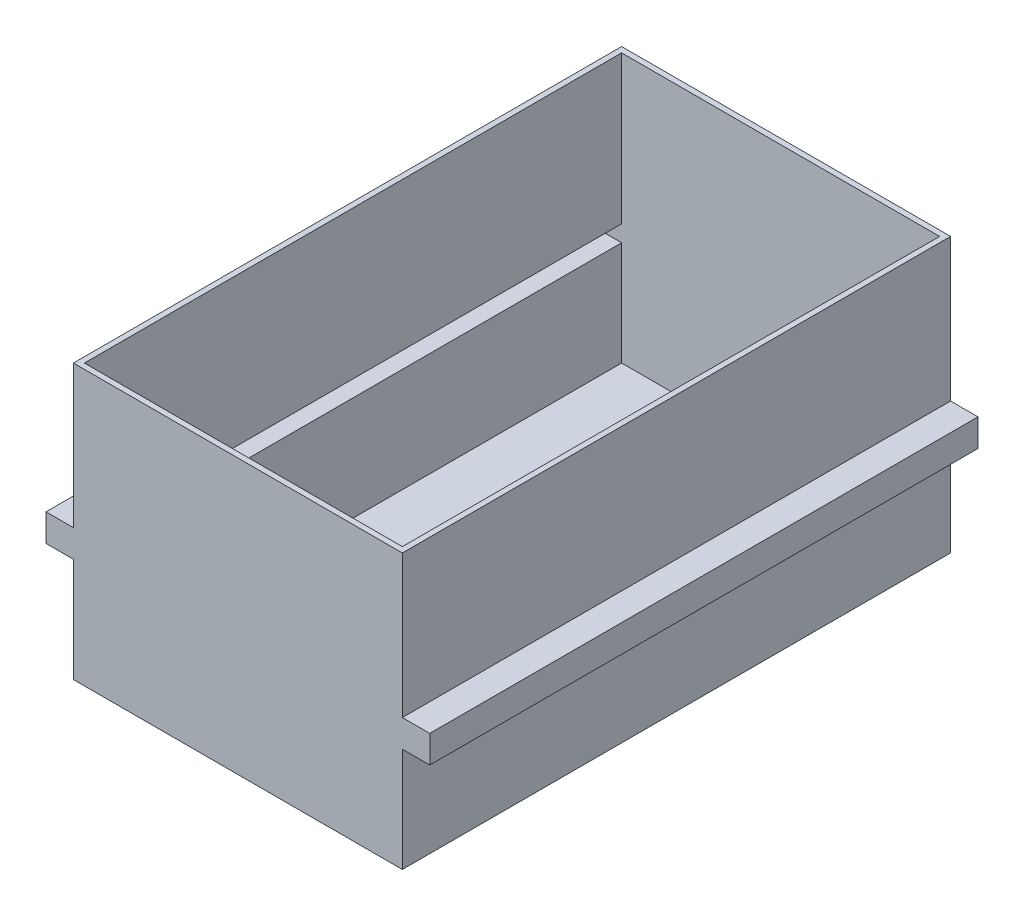
ISO-10303-21;
HEADER;
FILE_DESCRIPTION(('STEP AP214'),'2;1');
FILE_NAME('part.step','',(''),(''),'','','');
FILE_SCHEMA(('AUTOMOTIVE_DESIGN { 1 0 10303 214 1 1 1 1 }'));
ENDSEC;
DATA;
#1=APPLICATION_CONTEXT('core data for automotive mechanical design processes');
#2=APPLICATION_PROTOCOL_DEFINITION('international standard','automotive_design',2000,#1);
#3=PRODUCT_CONTEXT('',#1,'mechanical');
#4=PRODUCT('Part','Part','',(#3));
#5=PRODUCT_RELATED_PRODUCT_CATEGORY('part','',(#4));
#6=PRODUCT_DEFINITION_FORMATION('','',#4);
#7=PRODUCT_DEFINITION_CONTEXT('part definition',#1,'design');
#8=PRODUCT_DEFINITION('design','',#6,#7);
#9=PRODUCT_DEFINITION_SHAPE('','',#8);
#10=(LENGTH_UNIT() NAMED_UNIT(*) SI_UNIT(.MILLI.,.METRE.));
#11=(NAMED_UNIT(*) PLANE_ANGLE_UNIT() SI_UNIT($,.RADIAN.));
#12=(NAMED_UNIT(*) SI_UNIT($,.STERADIAN.) SOLID_ANGLE_UNIT());
#13=UNCERTAINTY_MEASURE_WITH_UNIT(LENGTH_MEASURE(1.E-05),#10,'distance_accuracy_value','');
#14=(GEOMETRIC_REPRESENTATION_CONTEXT(3) GLOBAL_UNCERTAINTY_ASSIGNED_CONTEXT((#13)) GLOBAL_UNIT_ASSIGNED_CONTEXT((#10,
#11,#12)) REPRESENTATION_CONTEXT('',''));
#15=CARTESIAN_POINT('',(0.,0.,0.));
#16=DIRECTION('',(0.,0.,1.));
#17=DIRECTION('',(1.,0.,0.));
#18=AXIS2_PLACEMENT_3D('',#15,#16,#17);
#19=CARTESIAN_POINT('',(150.,125.,500.));
#20=DIRECTION('',(0.,-1.,0.));
#21=DIRECTION('',(1.,0.,0.));
#22=AXIS2_PLACEMENT_3D('',#19,#20,#21);
#23=PLANE('',#22);
#24=DIRECTION('',(-1.,0.,0.));
#25=VECTOR('',#24,1.);
#26=CARTESIAN_POINT('',(150.,125.,0.));
#27=LINE('',#26,#25);
#28=CARTESIAN_POINT('',(150.,125.,0.));
#29=VERTEX_POINT('',#28);
#30=CARTESIAN_POINT('',(-150.,125.,0.));
#31=VERTEX_POINT('',#30);
#32=EDGE_CURVE('E434',#29,#31,#27,.T.);
#33=ORIENTED_EDGE('',*,*,#32,.T.);
#34=DIRECTION('',(0.,0.,-1.));
#35=VECTOR('',#34,1.);
#36=CARTESIAN_POINT('',(-150.,125.,500.));
#37=LINE('',#36,#35);
#38=CARTESIAN_POINT('',(-150.,125.,500.));
#39=VERTEX_POINT('',#38);
#40=EDGE_CURVE('E421',#39,#31,#37,.T.);
#41=ORIENTED_EDGE('',*,*,#40,.F.);
#42=DIRECTION('',(-1.,0.,0.));
#43=VECTOR('',#42,1.);
#44=CARTESIAN_POINT('',(150.,125.,500.));
#45=LINE('',#44,#43);
#46=CARTESIAN_POINT('',(150.,125.,500.));
#47=VERTEX_POINT('',#46);
#48=EDGE_CURVE('E418',#47,#39,#45,.T.);
#49=ORIENTED_EDGE('',*,*,#48,.F.);
#50=DIRECTION('',(0.,0.,-1.));
#51=VECTOR('',#50,1.);
#52=CARTESIAN_POINT('',(150.,125.,500.));
#53=LINE('',#52,#51);
#54=EDGE_CURVE('E440',#47,#29,#53,.T.);
#55=ORIENTED_EDGE('',*,*,#54,.T.);
#56=EDGE_LOOP('',(#33,#41,#49,#55));
#57=FACE_BOUND('',#56,.T.);
#58=DIRECTION('',(-1.,0.,0.));
#59=VECTOR('',#58,1.);
#60=CARTESIAN_POINT('',(150.,125.,5.));
#61=LINE('',#60,#59);
#62=CARTESIAN_POINT('',(145.,125.,5.));
#63=VERTEX_POINT('',#62);
#64=CARTESIAN_POINT('',(-145.,125.,5.));
#65=VERTEX_POINT('',#64);
#66=EDGE_CURVE('E230',#63,#65,#61,.T.);
#67=ORIENTED_EDGE('',*,*,#66,.F.);
#68=DIRECTION('',(0.,0.,-1.));
#69=VECTOR('',#68,1.);
#70=CARTESIAN_POINT('',(145.,125.,500.));
#71=LINE('',#70,#69);
#72=CARTESIAN_POINT('',(145.,125.,495.));
#73=VERTEX_POINT('',#72);
#74=EDGE_CURVE('E316',#73,#63,#71,.T.);
#75=ORIENTED_EDGE('',*,*,#74,.F.);
#76=DIRECTION('',(-1.,0.,0.));
#77=VECTOR('',#76,1.);
#78=CARTESIAN_POINT('',(150.,125.,495.));
#79=LINE('',#78,#77);
#80=CARTESIAN_POINT('',(-145.,125.,495.));
#81=VERTEX_POINT('',#80);
#82=EDGE_CURVE('E55',#73,#81,#79,.T.);
#83=ORIENTED_EDGE('',*,*,#82,.T.);
#84=DIRECTION('',(0.,0.,-1.));
#85=VECTOR('',#84,1.);
#86=CARTESIAN_POINT('',(-145.,125.,500.));
#87=LINE('',#86,#85);
#88=EDGE_CURVE('E331',#81,#65,#87,.T.);
#89=ORIENTED_EDGE('',*,*,#88,.T.);
#90=EDGE_LOOP('',(#67,#75,#83,#89));
#91=FACE_BOUND('',#90,.T.);
#92=ADVANCED_FACE('F39',(#57,#91),#23,.F.);
#93=CARTESIAN_POINT('',(-150.,-125.,500.));
#94=DIRECTION('',(1.,0.,0.));
#95=DIRECTION('',(0.,0.,-1.));
#96=AXIS2_PLACEMENT_3D('',#93,#94,#95);
#97=PLANE('',#96);
#98=DIRECTION('',(0.,-1.,0.));
#99=VECTOR('',#98,1.);
#100=CARTESIAN_POINT('',(-150.,-125.,0.));
#101=LINE('',#100,#99);
#102=CARTESIAN_POINT('',(-150.,-4.99999999999998,0.));
#103=VERTEX_POINT('',#102);
#104=EDGE_CURVE('E422',#31,#103,#101,.T.);
#105=ORIENTED_EDGE('',*,*,#104,.T.);
#106=DIRECTION('',(0.,0.,1.));
#107=VECTOR('',#106,1.);
#108=CARTESIAN_POINT('',(-150.,-4.99999999999998,500.));
#109=LINE('',#108,#107);
#110=CARTESIAN_POINT('',(-150.,-4.99999999999998,500.));
#111=VERTEX_POINT('',#110);
#112=EDGE_CURVE('E400',#103,#111,#109,.T.);
#113=ORIENTED_EDGE('',*,*,#112,.T.);
#114=DIRECTION('',(0.,-1.,0.));
#115=VECTOR('',#114,1.);
#116=CARTESIAN_POINT('',(-150.,-125.,500.));
#117=LINE('',#116,#115);
#118=EDGE_CURVE('E405',#39,#111,#117,.T.);
#119=ORIENTED_EDGE('',*,*,#118,.F.);
#120=ORIENTED_EDGE('',*,*,#40,.T.);
#121=EDGE_LOOP('',(#105,#113,#119,#120));
#122=FACE_BOUND('',#121,.T.);
#123=ADVANCED_FACE('F500',(#122),#97,.F.);
#124=CARTESIAN_POINT('',(150.,-125.,500.));
#125=DIRECTION('',(-1.,0.,0.));
#126=DIRECTION('',(0.,0.,1.));
#127=AXIS2_PLACEMENT_3D('',#124,#125,#126);
#128=PLANE('',#127);
#129=DIRECTION('',(0.,1.,0.));
#130=VECTOR('',#129,1.);
#131=CARTESIAN_POINT('',(150.,-125.,500.));
#132=LINE('',#131,#130);
#133=CARTESIAN_POINT('',(150.,-4.99999999999998,500.));
#134=VERTEX_POINT('',#133);
#135=EDGE_CURVE('E413',#134,#47,#132,.T.);
#136=ORIENTED_EDGE('',*,*,#135,.F.);
#137=DIRECTION('',(0.,0.,-1.));
#138=VECTOR('',#137,1.);
#139=CARTESIAN_POINT('',(150.,-4.99999999999998,500.));
#140=LINE('',#139,#138);
#141=CARTESIAN_POINT('',(150.,-4.99999999999998,0.));
#142=VERTEX_POINT('',#141);
#143=EDGE_CURVE('E396',#134,#142,#140,.T.);
#144=ORIENTED_EDGE('',*,*,#143,.T.);
#145=DIRECTION('',(0.,1.,0.));
#146=VECTOR('',#145,1.);
#147=CARTESIAN_POINT('',(150.,-125.,0.));
#148=LINE('',#147,#146);
#149=EDGE_CURVE('E429',#142,#29,#148,.T.);
#150=ORIENTED_EDGE('',*,*,#149,.T.);
#151=ORIENTED_EDGE('',*,*,#54,.F.);
#152=EDGE_LOOP('',(#136,#144,#150,#151));
#153=FACE_BOUND('',#152,.T.);
#154=ADVANCED_FACE('F495',(#153),#128,.F.);
#155=CARTESIAN_POINT('',(-150.,-30.,500.));
#156=VERTEX_POINT('',#155);
#157=CARTESIAN_POINT('',(-150.,-125.,500.));
#158=VERTEX_POINT('',#157);
#159=EDGE_CURVE('E410',#156,#158,#117,.T.);
#160=ORIENTED_EDGE('',*,*,#159,.F.);
#161=DIRECTION('',(0.,0.,-1.));
#162=VECTOR('',#161,1.);
#163=CARTESIAN_POINT('',(-150.,-30.,500.));
#164=LINE('',#163,#162);
#165=CARTESIAN_POINT('',(-150.,-30.,0.));
#166=VERTEX_POINT('',#165);
#167=EDGE_CURVE('E392',#156,#166,#164,.T.);
#168=ORIENTED_EDGE('',*,*,#167,.T.);
#169=CARTESIAN_POINT('',(-150.,-125.,0.));
#170=VERTEX_POINT('',#169);
#171=EDGE_CURVE('E404',#166,#170,#101,.T.);
#172=ORIENTED_EDGE('',*,*,#171,.T.);
#173=DIRECTION('',(0.,0.,-1.));
#174=VECTOR('',#173,1.);
#175=CARTESIAN_POINT('',(-150.,-125.,500.));
#176=LINE('',#175,#174);
#177=EDGE_CURVE('E11',#158,#170,#176,.T.);
#178=ORIENTED_EDGE('',*,*,#177,.F.);
#179=EDGE_LOOP('',(#160,#168,#172,#178));
#180=FACE_BOUND('',#179,.T.);
#181=ADVANCED_FACE('F41',(#180),#97,.F.);
#182=CARTESIAN_POINT('',(150.,-125.,500.));
#183=DIRECTION('',(0.,1.,0.));
#184=DIRECTION('',(-1.,0.,0.));
#185=AXIS2_PLACEMENT_3D('',#182,#183,#184);
#186=PLANE('',#185);
#187=DIRECTION('',(1.,0.,0.));
#188=VECTOR('',#187,1.);
#189=CARTESIAN_POINT('',(150.,-125.,0.));
#190=LINE('',#189,#188);
#191=CARTESIAN_POINT('',(150.,-125.,0.));
#192=VERTEX_POINT('',#191);
#193=EDGE_CURVE('E426',#170,#192,#190,.T.);
#194=ORIENTED_EDGE('',*,*,#193,.T.);
#195=DIRECTION('',(0.,0.,-1.));
#196=VECTOR('',#195,1.);
#197=CARTESIAN_POINT('',(150.,-125.,500.));
#198=LINE('',#197,#196);
#199=CARTESIAN_POINT('',(150.,-125.,500.));
#200=VERTEX_POINT('',#199);
#201=EDGE_CURVE('E48',#200,#192,#198,.T.);
#202=ORIENTED_EDGE('',*,*,#201,.F.);
#203=DIRECTION('',(1.,0.,0.));
#204=VECTOR('',#203,1.);
#205=CARTESIAN_POINT('',(150.,-125.,500.));
#206=LINE('',#205,#204);
#207=EDGE_CURVE('E409',#158,#200,#206,.T.);
#208=ORIENTED_EDGE('',*,*,#207,.F.);
#209=ORIENTED_EDGE('',*,*,#177,.T.);
#210=EDGE_LOOP('',(#194,#202,#208,#209));
#211=FACE_BOUND('',#210,.T.);
#212=ADVANCED_FACE('F520',(#211),#186,.F.);
#213=CARTESIAN_POINT('',(150.,-30.,0.));
#214=VERTEX_POINT('',#213);
#215=EDGE_CURVE('E430',#192,#214,#148,.T.);
#216=ORIENTED_EDGE('',*,*,#215,.T.);
#217=DIRECTION('',(0.,0.,1.));
#218=VECTOR('',#217,1.);
#219=CARTESIAN_POINT('',(150.,-30.,500.));
#220=LINE('',#219,#218);
#221=CARTESIAN_POINT('',(150.,-30.,500.));
#222=VERTEX_POINT('',#221);
#223=EDGE_CURVE('E375',#214,#222,#220,.T.);
#224=ORIENTED_EDGE('',*,*,#223,.T.);
#225=EDGE_CURVE('E414',#200,#222,#132,.T.);
#226=ORIENTED_EDGE('',*,*,#225,.F.);
#227=ORIENTED_EDGE('',*,*,#201,.T.);
#228=EDGE_LOOP('',(#216,#224,#226,#227));
#229=FACE_BOUND('',#228,.T.);
#230=ADVANCED_FACE('F449',(#229),#128,.F.);
#231=CARTESIAN_POINT('',(0.,0.,500.));
#232=DIRECTION('',(0.,0.,1.));
#233=DIRECTION('',(1.,0.,0.));
#234=AXIS2_PLACEMENT_3D('',#231,#232,#233);
#235=PLANE('',#234);
#236=ORIENTED_EDGE('',*,*,#225,.T.);
#237=DIRECTION('',(1.,0.,0.));
#238=VECTOR('',#237,1.);
#239=CARTESIAN_POINT('',(-175.,-30.,500.));
#240=LINE('',#239,#238);
#241=CARTESIAN_POINT('',(175.,-30.,500.));
#242=VERTEX_POINT('',#241);
#243=EDGE_CURVE('E63',#222,#242,#240,.T.);
#244=ORIENTED_EDGE('',*,*,#243,.T.);
#245=DIRECTION('',(0.,-1.,0.));
#246=VECTOR('',#245,1.);
#247=CARTESIAN_POINT('',(175.,-4.99999999999998,500.));
#248=LINE('',#247,#246);
#249=CARTESIAN_POINT('',(175.,-4.99999999999998,500.));
#250=VERTEX_POINT('',#249);
#251=EDGE_CURVE('E311',#250,#242,#248,.T.);
#252=ORIENTED_EDGE('',*,*,#251,.F.);
#253=DIRECTION('',(1.,0.,0.));
#254=VECTOR('',#253,1.);
#255=CARTESIAN_POINT('',(-175.,-4.99999999999998,500.));
#256=LINE('',#255,#254);
#257=EDGE_CURVE('E376',#134,#250,#256,.T.);
#258=ORIENTED_EDGE('',*,*,#257,.F.);
#259=ORIENTED_EDGE('',*,*,#135,.T.);
#260=ORIENTED_EDGE('',*,*,#48,.T.);
#261=ORIENTED_EDGE('',*,*,#118,.T.);
#262=CARTESIAN_POINT('',(-175.,-4.99999999999998,500.));
#263=VERTEX_POINT('',#262);
#264=EDGE_CURVE('E372',#263,#111,#256,.T.);
#265=ORIENTED_EDGE('',*,*,#264,.F.);
#266=DIRECTION('',(0.,-1.,0.));
#267=VECTOR('',#266,1.);
#268=CARTESIAN_POINT('',(-175.,-4.99999999999998,500.));
#269=LINE('',#268,#267);
#270=CARTESIAN_POINT('',(-175.,-30.,500.));
#271=VERTEX_POINT('',#270);
#272=EDGE_CURVE('E356',#263,#271,#269,.T.);
#273=ORIENTED_EDGE('',*,*,#272,.T.);
#274=EDGE_CURVE('E386',#271,#156,#240,.T.);
#275=ORIENTED_EDGE('',*,*,#274,.T.);
#276=ORIENTED_EDGE('',*,*,#159,.T.);
#277=ORIENTED_EDGE('',*,*,#207,.T.);
#278=EDGE_LOOP('',(#236,#244,#252,#258,#259,#260,#261,#265,#273,#275,#276,#277));
#279=FACE_BOUND('',#278,.T.);
#280=ADVANCED_FACE('F463',(#279),#235,.T.);
#281=CARTESIAN_POINT('',(0.,0.,0.));
#282=DIRECTION('',(0.,0.,1.));
#283=DIRECTION('',(1.,0.,0.));
#284=AXIS2_PLACEMENT_3D('',#281,#282,#283);
#285=PLANE('',#284);
#286=ORIENTED_EDGE('',*,*,#171,.F.);
#287=DIRECTION('',(1.,0.,0.));
#288=VECTOR('',#287,1.);
#289=CARTESIAN_POINT('',(-175.,-30.,0.));
#290=LINE('',#289,#288);
#291=CARTESIAN_POINT('',(-175.,-30.,0.));
#292=VERTEX_POINT('',#291);
#293=EDGE_CURVE('E382',#292,#166,#290,.T.);
#294=ORIENTED_EDGE('',*,*,#293,.F.);
#295=DIRECTION('',(0.,1.,0.));
#296=VECTOR('',#295,1.);
#297=CARTESIAN_POINT('',(-175.,-4.99999999999998,0.));
#298=LINE('',#297,#296);
#299=CARTESIAN_POINT('',(-175.,-4.99999999999998,0.));
#300=VERTEX_POINT('',#299);
#301=EDGE_CURVE('E364',#292,#300,#298,.T.);
#302=ORIENTED_EDGE('',*,*,#301,.T.);
#303=DIRECTION('',(1.,0.,0.));
#304=VECTOR('',#303,1.);
#305=CARTESIAN_POINT('',(-175.,-4.99999999999998,0.));
#306=LINE('',#305,#304);
#307=EDGE_CURVE('E377',#300,#103,#306,.T.);
#308=ORIENTED_EDGE('',*,*,#307,.T.);
#309=ORIENTED_EDGE('',*,*,#104,.F.);
#310=ORIENTED_EDGE('',*,*,#32,.F.);
#311=ORIENTED_EDGE('',*,*,#149,.F.);
#312=CARTESIAN_POINT('',(175.,-4.99999999999998,0.));
#313=VERTEX_POINT('',#312);
#314=EDGE_CURVE('E381',#142,#313,#306,.T.);
#315=ORIENTED_EDGE('',*,*,#314,.T.);
#316=DIRECTION('',(0.,1.,0.));
#317=VECTOR('',#316,1.);
#318=CARTESIAN_POINT('',(175.,-4.99999999999998,0.));
#319=LINE('',#318,#317);
#320=CARTESIAN_POINT('',(175.,-30.,0.));
#321=VERTEX_POINT('',#320);
#322=EDGE_CURVE('E348',#321,#313,#319,.T.);
#323=ORIENTED_EDGE('',*,*,#322,.F.);
#324=EDGE_CURVE('E385',#214,#321,#290,.T.);
#325=ORIENTED_EDGE('',*,*,#324,.F.);
#326=ORIENTED_EDGE('',*,*,#215,.F.);
#327=ORIENTED_EDGE('',*,*,#193,.F.);
#328=EDGE_LOOP('',(#286,#294,#302,#308,#309,#310,#311,#315,#323,#325,#326,#327));
#329=FACE_BOUND('',#328,.T.);
#330=ADVANCED_FACE('F456',(#329),#285,.F.);
#331=CARTESIAN_POINT('',(175.,0.,0.));
#332=DIRECTION('',(1.,0.,0.));
#333=DIRECTION('',(0.,0.,-1.));
#334=AXIS2_PLACEMENT_3D('',#331,#332,#333);
#335=PLANE('',#334);
#336=ORIENTED_EDGE('',*,*,#251,.T.);
#337=DIRECTION('',(0.,0.,-1.));
#338=VECTOR('',#337,1.);
#339=CARTESIAN_POINT('',(175.,-30.,500.));
#340=LINE('',#339,#338);
#341=EDGE_CURVE('E344',#242,#321,#340,.T.);
#342=ORIENTED_EDGE('',*,*,#341,.T.);
#343=ORIENTED_EDGE('',*,*,#322,.T.);
#344=DIRECTION('',(0.,0.,1.));
#345=VECTOR('',#344,1.);
#346=CARTESIAN_POINT('',(175.,-4.99999999999998,500.));
#347=LINE('',#346,#345);
#348=EDGE_CURVE('E352',#313,#250,#347,.T.);
#349=ORIENTED_EDGE('',*,*,#348,.T.);
#350=EDGE_LOOP('',(#336,#342,#343,#349));
#351=FACE_BOUND('',#350,.T.);
#352=ADVANCED_FACE('F467',(#351),#335,.T.);
#353=CARTESIAN_POINT('',(-175.,-30.,500.));
#354=DIRECTION('',(0.,-1.,0.));
#355=DIRECTION('',(0.,0.,-1.));
#356=AXIS2_PLACEMENT_3D('',#353,#354,#355);
#357=PLANE('',#356);
#358=ORIENTED_EDGE('',*,*,#223,.F.);
#359=ORIENTED_EDGE('',*,*,#324,.T.);
#360=ORIENTED_EDGE('',*,*,#341,.F.);
#361=ORIENTED_EDGE('',*,*,#243,.F.);
#362=EDGE_LOOP('',(#358,#359,#360,#361));
#363=FACE_BOUND('',#362,.T.);
#364=ADVANCED_FACE('F465',(#363),#357,.T.);
#365=CARTESIAN_POINT('',(-175.,-4.99999999999998,500.));
#366=DIRECTION('',(0.,1.,0.));
#367=DIRECTION('',(0.,0.,1.));
#368=AXIS2_PLACEMENT_3D('',#365,#366,#367);
#369=PLANE('',#368);
#370=ORIENTED_EDGE('',*,*,#143,.F.);
#371=ORIENTED_EDGE('',*,*,#257,.T.);
#372=ORIENTED_EDGE('',*,*,#348,.F.);
#373=ORIENTED_EDGE('',*,*,#314,.F.);
#374=EDGE_LOOP('',(#370,#371,#372,#373));
#375=FACE_BOUND('',#374,.T.);
#376=ADVANCED_FACE('F470',(#375),#369,.T.);
#377=ORIENTED_EDGE('',*,*,#112,.F.);
#378=ORIENTED_EDGE('',*,*,#307,.F.);
#379=DIRECTION('',(0.,0.,1.));
#380=VECTOR('',#379,1.);
#381=CARTESIAN_POINT('',(-175.,-4.99999999999998,500.));
#382=LINE('',#381,#380);
#383=EDGE_CURVE('E368',#300,#263,#382,.T.);
#384=ORIENTED_EDGE('',*,*,#383,.T.);
#385=ORIENTED_EDGE('',*,*,#264,.T.);
#386=EDGE_LOOP('',(#377,#378,#384,#385));
#387=FACE_BOUND('',#386,.T.);
#388=ADVANCED_FACE('F502',(#387),#369,.T.);
#389=ORIENTED_EDGE('',*,*,#167,.F.);
#390=ORIENTED_EDGE('',*,*,#274,.F.);
#391=DIRECTION('',(0.,0.,-1.));
#392=VECTOR('',#391,1.);
#393=CARTESIAN_POINT('',(-175.,-30.,500.));
#394=LINE('',#393,#392);
#395=EDGE_CURVE('E360',#271,#292,#394,.T.);
#396=ORIENTED_EDGE('',*,*,#395,.T.);
#397=ORIENTED_EDGE('',*,*,#293,.T.);
#398=EDGE_LOOP('',(#389,#390,#396,#397));
#399=FACE_BOUND('',#398,.T.);
#400=ADVANCED_FACE('F490',(#399),#357,.T.);
#401=CARTESIAN_POINT('',(-175.,0.,0.));
#402=DIRECTION('',(1.,0.,0.));
#403=DIRECTION('',(0.,0.,-1.));
#404=AXIS2_PLACEMENT_3D('',#401,#402,#403);
#405=PLANE('',#404);
#406=ORIENTED_EDGE('',*,*,#272,.F.);
#407=ORIENTED_EDGE('',*,*,#383,.F.);
#408=ORIENTED_EDGE('',*,*,#301,.F.);
#409=ORIENTED_EDGE('',*,*,#395,.F.);
#410=EDGE_LOOP('',(#406,#407,#408,#409));
#411=FACE_BOUND('',#410,.T.);
#412=ADVANCED_FACE('F489',(#411),#405,.F.);
#413=CARTESIAN_POINT('',(-145.,-125.,500.));
#414=DIRECTION('',(1.,0.,0.));
#415=DIRECTION('',(0.,0.,-1.));
#416=AXIS2_PLACEMENT_3D('',#413,#414,#415);
#417=PLANE('',#416);
#418=DIRECTION('',(0.,-1.,0.));
#419=VECTOR('',#418,1.);
#420=CARTESIAN_POINT('',(-145.,-125.,5.));
#421=LINE('',#420,#419);
#422=CARTESIAN_POINT('',(-145.,-9.99999999999998,5.));
#423=VERTEX_POINT('',#422);
#424=EDGE_CURVE('E208',#65,#423,#421,.T.);
#425=ORIENTED_EDGE('',*,*,#424,.F.);
#426=ORIENTED_EDGE('',*,*,#88,.F.);
#427=DIRECTION('',(0.,-1.,0.));
#428=VECTOR('',#427,1.);
#429=CARTESIAN_POINT('',(-145.,-125.,495.));
#430=LINE('',#429,#428);
#431=CARTESIAN_POINT('',(-145.,-9.99999999999998,495.));
#432=VERTEX_POINT('',#431);
#433=EDGE_CURVE('E210',#81,#432,#430,.T.);
#434=ORIENTED_EDGE('',*,*,#433,.T.);
#435=DIRECTION('',(0.,0.,1.));
#436=VECTOR('',#435,1.);
#437=CARTESIAN_POINT('',(-145.,-9.99999999999998,500.));
#438=LINE('',#437,#436);
#439=EDGE_CURVE('E204',#423,#432,#438,.T.);
#440=ORIENTED_EDGE('',*,*,#439,.F.);
#441=EDGE_LOOP('',(#425,#426,#434,#440));
#442=FACE_BOUND('',#441,.T.);
#443=ADVANCED_FACE('F206',(#442),#417,.T.);
#444=CARTESIAN_POINT('',(145.,-125.,500.));
#445=DIRECTION('',(-1.,0.,0.));
#446=DIRECTION('',(0.,0.,1.));
#447=AXIS2_PLACEMENT_3D('',#444,#445,#446);
#448=PLANE('',#447);
#449=DIRECTION('',(0.,1.,0.));
#450=VECTOR('',#449,1.);
#451=CARTESIAN_POINT('',(145.,-125.,495.));
#452=LINE('',#451,#450);
#453=CARTESIAN_POINT('',(145.,-9.99999999999998,495.));
#454=VERTEX_POINT('',#453);
#455=EDGE_CURVE('E248',#454,#73,#452,.T.);
#456=ORIENTED_EDGE('',*,*,#455,.T.);
#457=ORIENTED_EDGE('',*,*,#74,.T.);
#458=DIRECTION('',(0.,1.,0.));
#459=VECTOR('',#458,1.);
#460=CARTESIAN_POINT('',(145.,-125.,5.));
#461=LINE('',#460,#459);
#462=CARTESIAN_POINT('',(145.,-9.99999999999998,5.));
#463=VERTEX_POINT('',#462);
#464=EDGE_CURVE('E236',#463,#63,#461,.T.);
#465=ORIENTED_EDGE('',*,*,#464,.F.);
#466=DIRECTION('',(0.,0.,-1.));
#467=VECTOR('',#466,1.);
#468=CARTESIAN_POINT('',(145.,-9.99999999999998,500.));
#469=LINE('',#468,#467);
#470=EDGE_CURVE('E214',#454,#463,#469,.T.);
#471=ORIENTED_EDGE('',*,*,#470,.F.);
#472=EDGE_LOOP('',(#456,#457,#465,#471));
#473=FACE_BOUND('',#472,.T.);
#474=ADVANCED_FACE('F612',(#473),#448,.T.);
#475=DIRECTION('',(0.,-1.,0.));
#476=VECTOR('',#475,1.);
#477=CARTESIAN_POINT('',(-145.,-125.,495.));
#478=LINE('',#477,#476);
#479=CARTESIAN_POINT('',(-145.,-25.,495.));
#480=VERTEX_POINT('',#479);
#481=CARTESIAN_POINT('',(-145.,-120.,495.));
#482=VERTEX_POINT('',#481);
#483=EDGE_CURVE('E243',#480,#482,#478,.T.);
#484=ORIENTED_EDGE('',*,*,#483,.T.);
#485=DIRECTION('',(0.,0.,-1.));
#486=VECTOR('',#485,1.);
#487=CARTESIAN_POINT('',(-145.,-120.,500.));
#488=LINE('',#487,#486);
#489=CARTESIAN_POINT('',(-145.,-120.,5.));
#490=VERTEX_POINT('',#489);
#491=EDGE_CURVE('E307',#482,#490,#488,.T.);
#492=ORIENTED_EDGE('',*,*,#491,.T.);
#493=DIRECTION('',(0.,-1.,0.));
#494=VECTOR('',#493,1.);
#495=CARTESIAN_POINT('',(-145.,-125.,5.));
#496=LINE('',#495,#494);
#497=CARTESIAN_POINT('',(-145.,-25.,5.));
#498=VERTEX_POINT('',#497);
#499=EDGE_CURVE('E213',#498,#490,#496,.T.);
#500=ORIENTED_EDGE('',*,*,#499,.F.);
#501=DIRECTION('',(0.,0.,-1.));
#502=VECTOR('',#501,1.);
#503=CARTESIAN_POINT('',(-145.,-25.,500.));
#504=LINE('',#503,#502);
#505=EDGE_CURVE('E283',#480,#498,#504,.T.);
#506=ORIENTED_EDGE('',*,*,#505,.F.);
#507=EDGE_LOOP('',(#484,#492,#500,#506));
#508=FACE_BOUND('',#507,.T.);
#509=ADVANCED_FACE('F614',(#508),#417,.T.);
#510=CARTESIAN_POINT('',(150.,-120.,500.));
#511=DIRECTION('',(0.,1.,0.));
#512=DIRECTION('',(-1.,0.,0.));
#513=AXIS2_PLACEMENT_3D('',#510,#511,#512);
#514=PLANE('',#513);
#515=DIRECTION('',(1.,0.,0.));
#516=VECTOR('',#515,1.);
#517=CARTESIAN_POINT('',(150.,-120.,5.));
#518=LINE('',#517,#516);
#519=CARTESIAN_POINT('',(145.,-120.,5.));
#520=VERTEX_POINT('',#519);
#521=EDGE_CURVE('E232',#490,#520,#518,.T.);
#522=ORIENTED_EDGE('',*,*,#521,.F.);
#523=ORIENTED_EDGE('',*,*,#491,.F.);
#524=DIRECTION('',(1.,0.,0.));
#525=VECTOR('',#524,1.);
#526=CARTESIAN_POINT('',(150.,-120.,495.));
#527=LINE('',#526,#525);
#528=CARTESIAN_POINT('',(145.,-120.,495.));
#529=VERTEX_POINT('',#528);
#530=EDGE_CURVE('E242',#482,#529,#527,.T.);
#531=ORIENTED_EDGE('',*,*,#530,.T.);
#532=DIRECTION('',(0.,0.,-1.));
#533=VECTOR('',#532,1.);
#534=CARTESIAN_POINT('',(145.,-120.,500.));
#535=LINE('',#534,#533);
#536=EDGE_CURVE('E312',#529,#520,#535,.T.);
#537=ORIENTED_EDGE('',*,*,#536,.T.);
#538=EDGE_LOOP('',(#522,#523,#531,#537));
#539=FACE_BOUND('',#538,.T.);
#540=ADVANCED_FACE('F630',(#539),#514,.T.);
#541=DIRECTION('',(0.,1.,0.));
#542=VECTOR('',#541,1.);
#543=CARTESIAN_POINT('',(145.,-125.,5.));
#544=LINE('',#543,#542);
#545=CARTESIAN_POINT('',(145.,-25.,5.));
#546=VERTEX_POINT('',#545);
#547=EDGE_CURVE('E285',#520,#546,#544,.T.);
#548=ORIENTED_EDGE('',*,*,#547,.F.);
#549=ORIENTED_EDGE('',*,*,#536,.F.);
#550=DIRECTION('',(0.,1.,0.));
#551=VECTOR('',#550,1.);
#552=CARTESIAN_POINT('',(145.,-125.,495.));
#553=LINE('',#552,#551);
#554=CARTESIAN_POINT('',(145.,-25.,495.));
#555=VERTEX_POINT('',#554);
#556=EDGE_CURVE('E244',#529,#555,#553,.T.);
#557=ORIENTED_EDGE('',*,*,#556,.T.);
#558=DIRECTION('',(0.,0.,1.));
#559=VECTOR('',#558,1.);
#560=CARTESIAN_POINT('',(145.,-25.,500.));
#561=LINE('',#560,#559);
#562=EDGE_CURVE('E265',#546,#555,#561,.T.);
#563=ORIENTED_EDGE('',*,*,#562,.F.);
#564=EDGE_LOOP('',(#548,#549,#557,#563));
#565=FACE_BOUND('',#564,.T.);
#566=ADVANCED_FACE('F623',(#565),#448,.T.);
#567=CARTESIAN_POINT('',(0.,0.,495.));
#568=DIRECTION('',(0.,0.,1.));
#569=DIRECTION('',(1.,0.,0.));
#570=AXIS2_PLACEMENT_3D('',#567,#568,#569);
#571=PLANE('',#570);
#572=ORIENTED_EDGE('',*,*,#556,.F.);
#573=ORIENTED_EDGE('',*,*,#530,.F.);
#574=ORIENTED_EDGE('',*,*,#483,.F.);
#575=DIRECTION('',(1.,0.,0.));
#576=VECTOR('',#575,1.);
#577=CARTESIAN_POINT('',(0.,-25.,495.));
#578=LINE('',#577,#576);
#579=CARTESIAN_POINT('',(-170.,-25.,495.));
#580=VERTEX_POINT('',#579);
#581=EDGE_CURVE('E252',#580,#480,#578,.T.);
#582=ORIENTED_EDGE('',*,*,#581,.F.);
#583=DIRECTION('',(0.,-1.,0.));
#584=VECTOR('',#583,1.);
#585=CARTESIAN_POINT('',(-170.,0.,495.));
#586=LINE('',#585,#584);
#587=CARTESIAN_POINT('',(-170.,-9.99999999999998,495.));
#588=VERTEX_POINT('',#587);
#589=EDGE_CURVE('E266',#588,#580,#586,.T.);
#590=ORIENTED_EDGE('',*,*,#589,.F.);
#591=DIRECTION('',(1.,0.,0.));
#592=VECTOR('',#591,1.);
#593=CARTESIAN_POINT('',(-175.,-9.99999999999998,495.));
#594=LINE('',#593,#592);
#595=EDGE_CURVE('E260',#588,#432,#594,.T.);
#596=ORIENTED_EDGE('',*,*,#595,.T.);
#597=ORIENTED_EDGE('',*,*,#433,.F.);
#598=ORIENTED_EDGE('',*,*,#82,.F.);
#599=ORIENTED_EDGE('',*,*,#455,.F.);
#600=DIRECTION('',(1.,0.,0.));
#601=VECTOR('',#600,1.);
#602=CARTESIAN_POINT('',(-175.,-9.99999999999998,495.));
#603=LINE('',#602,#601);
#604=CARTESIAN_POINT('',(170.,-9.99999999999998,495.));
#605=VERTEX_POINT('',#604);
#606=EDGE_CURVE('E225',#454,#605,#603,.T.);
#607=ORIENTED_EDGE('',*,*,#606,.T.);
#608=DIRECTION('',(0.,-1.,0.));
#609=VECTOR('',#608,1.);
#610=CARTESIAN_POINT('',(170.,0.,495.));
#611=LINE('',#610,#609);
#612=CARTESIAN_POINT('',(170.,-25.,495.));
#613=VERTEX_POINT('',#612);
#614=EDGE_CURVE('E253',#605,#613,#611,.T.);
#615=ORIENTED_EDGE('',*,*,#614,.T.);
#616=DIRECTION('',(1.,0.,0.));
#617=VECTOR('',#616,1.);
#618=CARTESIAN_POINT('',(0.,-25.,495.));
#619=LINE('',#618,#617);
#620=EDGE_CURVE('E249',#555,#613,#619,.T.);
#621=ORIENTED_EDGE('',*,*,#620,.F.);
#622=EDGE_LOOP('',(#572,#573,#574,#582,#590,#596,#597,#598,#599,#607,#615,#621));
#623=FACE_BOUND('',#622,.T.);
#624=ADVANCED_FACE('F646',(#623),#571,.F.);
#625=CARTESIAN_POINT('',(0.,0.,5.));
#626=DIRECTION('',(0.,0.,1.));
#627=DIRECTION('',(1.,0.,0.));
#628=AXIS2_PLACEMENT_3D('',#625,#626,#627);
#629=PLANE('',#628);
#630=ORIENTED_EDGE('',*,*,#499,.T.);
#631=ORIENTED_EDGE('',*,*,#521,.T.);
#632=ORIENTED_EDGE('',*,*,#547,.T.);
#633=DIRECTION('',(1.,0.,0.));
#634=VECTOR('',#633,1.);
#635=CARTESIAN_POINT('',(0.,-25.,5.));
#636=LINE('',#635,#634);
#637=CARTESIAN_POINT('',(170.,-25.,5.));
#638=VERTEX_POINT('',#637);
#639=EDGE_CURVE('E275',#546,#638,#636,.T.);
#640=ORIENTED_EDGE('',*,*,#639,.T.);
#641=DIRECTION('',(0.,1.,0.));
#642=VECTOR('',#641,1.);
#643=CARTESIAN_POINT('',(170.,0.,5.));
#644=LINE('',#643,#642);
#645=CARTESIAN_POINT('',(170.,-9.99999999999998,5.));
#646=VERTEX_POINT('',#645);
#647=EDGE_CURVE('E295',#638,#646,#644,.T.);
#648=ORIENTED_EDGE('',*,*,#647,.T.);
#649=DIRECTION('',(1.,0.,0.));
#650=VECTOR('',#649,1.);
#651=CARTESIAN_POINT('',(-175.,-9.99999999999998,5.));
#652=LINE('',#651,#650);
#653=EDGE_CURVE('E226',#463,#646,#652,.T.);
#654=ORIENTED_EDGE('',*,*,#653,.F.);
#655=ORIENTED_EDGE('',*,*,#464,.T.);
#656=ORIENTED_EDGE('',*,*,#66,.T.);
#657=ORIENTED_EDGE('',*,*,#424,.T.);
#658=DIRECTION('',(1.,0.,0.));
#659=VECTOR('',#658,1.);
#660=CARTESIAN_POINT('',(-175.,-9.99999999999998,5.));
#661=LINE('',#660,#659);
#662=CARTESIAN_POINT('',(-170.,-9.99999999999998,5.));
#663=VERTEX_POINT('',#662);
#664=EDGE_CURVE('E217',#663,#423,#661,.T.);
#665=ORIENTED_EDGE('',*,*,#664,.F.);
#666=DIRECTION('',(0.,1.,0.));
#667=VECTOR('',#666,1.);
#668=CARTESIAN_POINT('',(-170.,0.,5.));
#669=LINE('',#668,#667);
#670=CARTESIAN_POINT('',(-170.,-25.,5.));
#671=VERTEX_POINT('',#670);
#672=EDGE_CURVE('E290',#671,#663,#669,.T.);
#673=ORIENTED_EDGE('',*,*,#672,.F.);
#674=DIRECTION('',(1.,0.,0.));
#675=VECTOR('',#674,1.);
#676=CARTESIAN_POINT('',(0.,-25.,5.));
#677=LINE('',#676,#675);
#678=EDGE_CURVE('E287',#671,#498,#677,.T.);
#679=ORIENTED_EDGE('',*,*,#678,.T.);
#680=EDGE_LOOP('',(#630,#631,#632,#640,#648,#654,#655,#656,#657,#665,#673,#679));
#681=FACE_BOUND('',#680,.T.);
#682=ADVANCED_FACE('F228',(#681),#629,.T.);
#683=CARTESIAN_POINT('',(170.,0.,0.));
#684=DIRECTION('',(1.,0.,0.));
#685=DIRECTION('',(0.,0.,-1.));
#686=AXIS2_PLACEMENT_3D('',#683,#684,#685);
#687=PLANE('',#686);
#688=ORIENTED_EDGE('',*,*,#614,.F.);
#689=DIRECTION('',(0.,0.,1.));
#690=VECTOR('',#689,1.);
#691=CARTESIAN_POINT('',(170.,-9.99999999999998,0.));
#692=LINE('',#691,#690);
#693=EDGE_CURVE('E271',#646,#605,#692,.T.);
#694=ORIENTED_EDGE('',*,*,#693,.F.);
#695=ORIENTED_EDGE('',*,*,#647,.F.);
#696=DIRECTION('',(0.,0.,-1.));
#697=VECTOR('',#696,1.);
#698=CARTESIAN_POINT('',(170.,-25.,0.));
#699=LINE('',#698,#697);
#700=EDGE_CURVE('E257',#613,#638,#699,.T.);
#701=ORIENTED_EDGE('',*,*,#700,.F.);
#702=EDGE_LOOP('',(#688,#694,#695,#701));
#703=FACE_BOUND('',#702,.T.);
#704=ADVANCED_FACE('F664',(#703),#687,.F.);
#705=CARTESIAN_POINT('',(-175.,-25.,500.));
#706=DIRECTION('',(0.,-1.,0.));
#707=DIRECTION('',(0.,0.,-1.));
#708=AXIS2_PLACEMENT_3D('',#705,#706,#707);
#709=PLANE('',#708);
#710=ORIENTED_EDGE('',*,*,#562,.T.);
#711=ORIENTED_EDGE('',*,*,#620,.T.);
#712=ORIENTED_EDGE('',*,*,#700,.T.);
#713=ORIENTED_EDGE('',*,*,#639,.F.);
#714=EDGE_LOOP('',(#710,#711,#712,#713));
#715=FACE_BOUND('',#714,.T.);
#716=ADVANCED_FACE('F675',(#715),#709,.F.);
#717=CARTESIAN_POINT('',(-175.,-9.99999999999998,500.));
#718=DIRECTION('',(0.,1.,0.));
#719=DIRECTION('',(0.,0.,1.));
#720=AXIS2_PLACEMENT_3D('',#717,#718,#719);
#721=PLANE('',#720);
#722=ORIENTED_EDGE('',*,*,#470,.T.);
#723=ORIENTED_EDGE('',*,*,#653,.T.);
#724=ORIENTED_EDGE('',*,*,#693,.T.);
#725=ORIENTED_EDGE('',*,*,#606,.F.);
#726=EDGE_LOOP('',(#722,#723,#724,#725));
#727=FACE_BOUND('',#726,.T.);
#728=ADVANCED_FACE('F684',(#727),#721,.F.);
#729=ORIENTED_EDGE('',*,*,#439,.T.);
#730=ORIENTED_EDGE('',*,*,#595,.F.);
#731=DIRECTION('',(0.,0.,1.));
#732=VECTOR('',#731,1.);
#733=CARTESIAN_POINT('',(-170.,-9.99999999999998,0.));
#734=LINE('',#733,#732);
#735=EDGE_CURVE('E220',#663,#588,#734,.T.);
#736=ORIENTED_EDGE('',*,*,#735,.F.);
#737=ORIENTED_EDGE('',*,*,#664,.T.);
#738=EDGE_LOOP('',(#729,#730,#736,#737));
#739=FACE_BOUND('',#738,.T.);
#740=ADVANCED_FACE('F218',(#739),#721,.F.);
#741=ORIENTED_EDGE('',*,*,#505,.T.);
#742=ORIENTED_EDGE('',*,*,#678,.F.);
#743=DIRECTION('',(0.,0.,-1.));
#744=VECTOR('',#743,1.);
#745=CARTESIAN_POINT('',(-170.,-25.,0.));
#746=LINE('',#745,#744);
#747=EDGE_CURVE('E270',#580,#671,#746,.T.);
#748=ORIENTED_EDGE('',*,*,#747,.F.);
#749=ORIENTED_EDGE('',*,*,#581,.T.);
#750=EDGE_LOOP('',(#741,#742,#748,#749));
#751=FACE_BOUND('',#750,.T.);
#752=ADVANCED_FACE('F687',(#751),#709,.F.);
#753=CARTESIAN_POINT('',(-170.,0.,0.));
#754=DIRECTION('',(1.,0.,0.));
#755=DIRECTION('',(0.,0.,-1.));
#756=AXIS2_PLACEMENT_3D('',#753,#754,#755);
#757=PLANE('',#756);
#758=ORIENTED_EDGE('',*,*,#589,.T.);
#759=ORIENTED_EDGE('',*,*,#747,.T.);
#760=ORIENTED_EDGE('',*,*,#672,.T.);
#761=ORIENTED_EDGE('',*,*,#735,.T.);
#762=EDGE_LOOP('',(#758,#759,#760,#761));
#763=FACE_BOUND('',#762,.T.);
#764=ADVANCED_FACE('F708',(#763),#757,.T.);
#765=CLOSED_SHELL('',(#92,#123,#154,#181,#212,#230,#280,#330,#352,#364,#376,#388,#400,#412,#443,
#474,#509,#540,#566,#624,#682,#704,#716,#728,#740,#752,#764));
#766=MANIFOLD_SOLID_BREP('B2',#765);
#767=ADVANCED_BREP_SHAPE_REPRESENTATION('',(#18,#766),#14);
#768=SHAPE_DEFINITION_REPRESENTATION(#9,#767);
ENDSEC;
END-ISO-10303-21;
